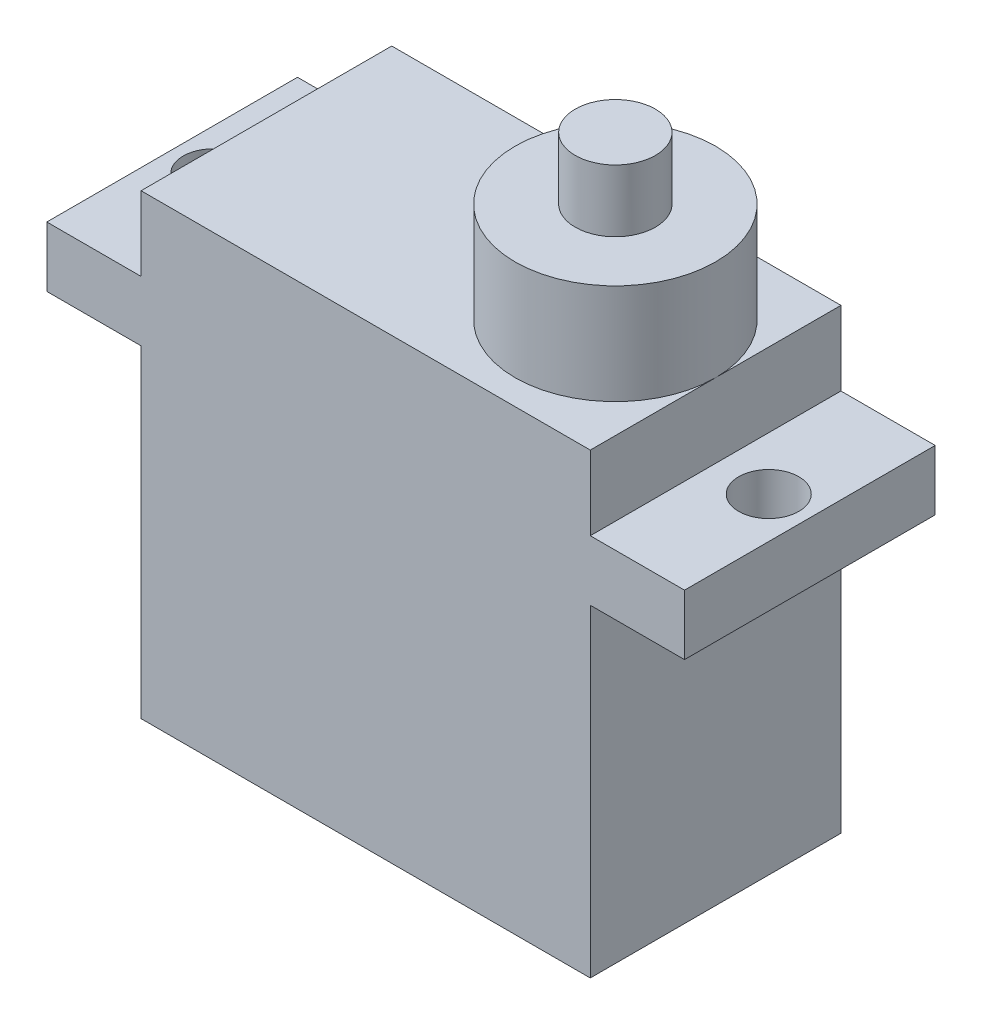
ISO-10303-21;
HEADER;
FILE_DESCRIPTION(('STEP AP214'),'2;1');
FILE_NAME('part.step','',(''),(''),'','','');
FILE_SCHEMA(('AUTOMOTIVE_DESIGN { 1 0 10303 214 1 1 1 1 }'));
ENDSEC;
DATA;
#1=APPLICATION_CONTEXT('core data for automotive mechanical design processes');
#2=APPLICATION_PROTOCOL_DEFINITION('international standard','automotive_design',2000,#1);
#3=PRODUCT_CONTEXT('',#1,'mechanical');
#4=PRODUCT('Part','Part','',(#3));
#5=PRODUCT_RELATED_PRODUCT_CATEGORY('part','',(#4));
#6=PRODUCT_DEFINITION_FORMATION('','',#4);
#7=PRODUCT_DEFINITION_CONTEXT('part definition',#1,'design');
#8=PRODUCT_DEFINITION('design','',#6,#7);
#9=PRODUCT_DEFINITION_SHAPE('','',#8);
#10=(LENGTH_UNIT() NAMED_UNIT(*) SI_UNIT(.MILLI.,.METRE.));
#11=(NAMED_UNIT(*) PLANE_ANGLE_UNIT() SI_UNIT($,.RADIAN.));
#12=(NAMED_UNIT(*) SI_UNIT($,.STERADIAN.) SOLID_ANGLE_UNIT());
#13=UNCERTAINTY_MEASURE_WITH_UNIT(LENGTH_MEASURE(1.E-05),#10,'distance_accuracy_value','');
#14=(GEOMETRIC_REPRESENTATION_CONTEXT(3) GLOBAL_UNCERTAINTY_ASSIGNED_CONTEXT((#13)) GLOBAL_UNIT_ASSIGNED_CONTEXT((#10,
#11,#12)) REPRESENTATION_CONTEXT('',''));
#15=CARTESIAN_POINT('',(0.,0.,0.));
#16=DIRECTION('',(0.,0.,1.));
#17=DIRECTION('',(1.,0.,0.));
#18=AXIS2_PLACEMENT_3D('',#15,#16,#17);
#19=CARTESIAN_POINT('',(0.,19.1,0.));
#20=DIRECTION('',(0.,1.,0.));
#21=DIRECTION('',(0.,0.,1.));
#22=AXIS2_PLACEMENT_3D('',#19,#20,#21);
#23=PLANE('',#22);
#24=DIRECTION('',(0.,0.,1.));
#25=VECTOR('',#24,1.);
#26=CARTESIAN_POINT('',(-11.2,19.1,0.));
#27=LINE('',#26,#25);
#28=CARTESIAN_POINT('',(-11.2,19.1,-6.25));
#29=VERTEX_POINT('',#28);
#30=CARTESIAN_POINT('',(-11.2,19.1,6.25));
#31=VERTEX_POINT('',#30);
#32=EDGE_CURVE('E44',#29,#31,#27,.T.);
#33=ORIENTED_EDGE('',*,*,#32,.F.);
#34=DIRECTION('',(-1.,0.,0.));
#35=VECTOR('',#34,1.);
#36=CARTESIAN_POINT('',(-15.9,19.1,-6.25));
#37=LINE('',#36,#35);
#38=CARTESIAN_POINT('',(-15.9,19.1,-6.25));
#39=VERTEX_POINT('',#38);
#40=EDGE_CURVE('E179',#29,#39,#37,.T.);
#41=ORIENTED_EDGE('',*,*,#40,.T.);
#42=DIRECTION('',(0.,0.,1.));
#43=VECTOR('',#42,1.);
#44=CARTESIAN_POINT('',(-15.9,19.1,-6.25));
#45=LINE('',#44,#43);
#46=CARTESIAN_POINT('',(-15.9,19.1,6.25));
#47=VERTEX_POINT('',#46);
#48=EDGE_CURVE('E183',#39,#47,#45,.T.);
#49=ORIENTED_EDGE('',*,*,#48,.T.);
#50=DIRECTION('',(1.,0.,0.));
#51=VECTOR('',#50,1.);
#52=CARTESIAN_POINT('',(-15.9,19.1,6.25));
#53=LINE('',#52,#51);
#54=EDGE_CURVE('E59',#47,#31,#53,.T.);
#55=ORIENTED_EDGE('',*,*,#54,.T.);
#56=EDGE_LOOP('',(#33,#41,#49,#55));
#57=FACE_BOUND('',#56,.T.);
#58=CARTESIAN_POINT('',(-13.85,19.1,0.));
#59=DIRECTION('',(0.,1.,0.));
#60=DIRECTION('',(0.,0.,1.));
#61=AXIS2_PLACEMENT_3D('',#58,#59,#60);
#62=CIRCLE('',#61,1.5);
#63=CARTESIAN_POINT('',(-13.85,19.1,1.5));
#64=VERTEX_POINT('',#63);
#65=EDGE_CURVE('E164',#64,#64,#62,.T.);
#66=ORIENTED_EDGE('',*,*,#65,.F.);
#67=EDGE_LOOP('',(#66));
#68=FACE_BOUND('',#67,.T.);
#69=ADVANCED_FACE('F36',(#57,#68),#23,.T.);
#70=CARTESIAN_POINT('',(11.2,16.1,-6.25));
#71=DIRECTION('',(-1.,0.,0.));
#72=DIRECTION('',(0.,0.,1.));
#73=AXIS2_PLACEMENT_3D('',#70,#71,#72);
#74=PLANE('',#73);
#75=DIRECTION('',(0.,0.,-1.));
#76=VECTOR('',#75,1.);
#77=CARTESIAN_POINT('',(11.2,0.,-6.25));
#78=LINE('',#77,#76);
#79=CARTESIAN_POINT('',(11.2,0.,6.25));
#80=VERTEX_POINT('',#79);
#81=CARTESIAN_POINT('',(11.2,0.,-6.25));
#82=VERTEX_POINT('',#81);
#83=EDGE_CURVE('E210',#80,#82,#78,.T.);
#84=ORIENTED_EDGE('',*,*,#83,.T.);
#85=DIRECTION('',(0.,-1.,0.));
#86=VECTOR('',#85,1.);
#87=CARTESIAN_POINT('',(11.2,16.1,-6.25));
#88=LINE('',#87,#86);
#89=CARTESIAN_POINT('',(11.2,16.1,-6.25));
#90=VERTEX_POINT('',#89);
#91=EDGE_CURVE('E234',#90,#82,#88,.T.);
#92=ORIENTED_EDGE('',*,*,#91,.F.);
#93=DIRECTION('',(0.,0.,-1.));
#94=VECTOR('',#93,1.);
#95=CARTESIAN_POINT('',(11.2,16.1,-6.25));
#96=LINE('',#95,#94);
#97=CARTESIAN_POINT('',(11.2,16.1,6.25));
#98=VERTEX_POINT('',#97);
#99=EDGE_CURVE('E211',#98,#90,#96,.T.);
#100=ORIENTED_EDGE('',*,*,#99,.F.);
#101=DIRECTION('',(0.,-1.,0.));
#102=VECTOR('',#101,1.);
#103=CARTESIAN_POINT('',(11.2,16.1,6.25));
#104=LINE('',#103,#102);
#105=EDGE_CURVE('E218',#98,#80,#104,.T.);
#106=ORIENTED_EDGE('',*,*,#105,.T.);
#107=EDGE_LOOP('',(#84,#92,#100,#106));
#108=FACE_BOUND('',#107,.T.);
#109=ADVANCED_FACE('F38',(#108),#74,.F.);
#110=CARTESIAN_POINT('',(-11.2,16.1,-6.25));
#111=DIRECTION('',(0.,0.,1.));
#112=DIRECTION('',(1.,0.,0.));
#113=AXIS2_PLACEMENT_3D('',#110,#111,#112);
#114=PLANE('',#113);
#115=DIRECTION('',(-1.,0.,0.));
#116=VECTOR('',#115,1.);
#117=CARTESIAN_POINT('',(-15.9,16.1,-6.25));
#118=LINE('',#117,#116);
#119=CARTESIAN_POINT('',(15.9,16.1,-6.25));
#120=VERTEX_POINT('',#119);
#121=EDGE_CURVE('E191',#120,#90,#118,.T.);
#122=ORIENTED_EDGE('',*,*,#121,.T.);
#123=ORIENTED_EDGE('',*,*,#91,.T.);
#124=DIRECTION('',(-1.,0.,0.));
#125=VECTOR('',#124,1.);
#126=CARTESIAN_POINT('',(-11.2,0.,-6.25));
#127=LINE('',#126,#125);
#128=CARTESIAN_POINT('',(-11.2,0.,-6.25));
#129=VERTEX_POINT('',#128);
#130=EDGE_CURVE('E221',#82,#129,#127,.T.);
#131=ORIENTED_EDGE('',*,*,#130,.T.);
#132=DIRECTION('',(0.,-1.,0.));
#133=VECTOR('',#132,1.);
#134=CARTESIAN_POINT('',(-11.2,16.1,-6.25));
#135=LINE('',#134,#133);
#136=CARTESIAN_POINT('',(-11.2,16.1,-6.25));
#137=VERTEX_POINT('',#136);
#138=EDGE_CURVE('E231',#137,#129,#135,.T.);
#139=ORIENTED_EDGE('',*,*,#138,.F.);
#140=CARTESIAN_POINT('',(-15.9,16.1,-6.25));
#141=VERTEX_POINT('',#140);
#142=EDGE_CURVE('E190',#137,#141,#118,.T.);
#143=ORIENTED_EDGE('',*,*,#142,.T.);
#144=DIRECTION('',(0.,-1.,0.));
#145=VECTOR('',#144,1.);
#146=CARTESIAN_POINT('',(-15.9,19.1,-6.25));
#147=LINE('',#146,#145);
#148=EDGE_CURVE('E204',#39,#141,#147,.T.);
#149=ORIENTED_EDGE('',*,*,#148,.F.);
#150=ORIENTED_EDGE('',*,*,#40,.F.);
#151=DIRECTION('',(0.,-1.,0.));
#152=VECTOR('',#151,1.);
#153=CARTESIAN_POINT('',(-11.2,22.8,-6.25));
#154=LINE('',#153,#152);
#155=CARTESIAN_POINT('',(-11.2,22.8,-6.25));
#156=VERTEX_POINT('',#155);
#157=EDGE_CURVE('E154',#156,#29,#154,.T.);
#158=ORIENTED_EDGE('',*,*,#157,.F.);
#159=DIRECTION('',(1.,0.,0.));
#160=VECTOR('',#159,1.);
#161=CARTESIAN_POINT('',(-11.2,22.8,-6.25));
#162=LINE('',#161,#160);
#163=CARTESIAN_POINT('',(11.2,22.8,-6.25));
#164=VERTEX_POINT('',#163);
#165=EDGE_CURVE('E148',#156,#164,#162,.T.);
#166=ORIENTED_EDGE('',*,*,#165,.T.);
#167=DIRECTION('',(0.,-1.,0.));
#168=VECTOR('',#167,1.);
#169=CARTESIAN_POINT('',(11.2,22.8,-6.25));
#170=LINE('',#169,#168);
#171=CARTESIAN_POINT('',(11.2,19.1,-6.25));
#172=VERTEX_POINT('',#171);
#173=EDGE_CURVE('E135',#164,#172,#170,.T.);
#174=ORIENTED_EDGE('',*,*,#173,.T.);
#175=CARTESIAN_POINT('',(15.9,19.1,-6.25));
#176=VERTEX_POINT('',#175);
#177=EDGE_CURVE('E181',#176,#172,#37,.T.);
#178=ORIENTED_EDGE('',*,*,#177,.F.);
#179=DIRECTION('',(0.,-1.,0.));
#180=VECTOR('',#179,1.);
#181=CARTESIAN_POINT('',(15.9,19.1,-6.25));
#182=LINE('',#181,#180);
#183=EDGE_CURVE('E207',#176,#120,#182,.T.);
#184=ORIENTED_EDGE('',*,*,#183,.T.);
#185=EDGE_LOOP('',(#122,#123,#131,#139,#143,#149,#150,#158,#166,#174,#178,#184));
#186=FACE_BOUND('',#185,.T.);
#187=ADVANCED_FACE('F244',(#186),#114,.F.);
#188=CARTESIAN_POINT('',(-11.2,16.1,-6.25));
#189=DIRECTION('',(1.,0.,0.));
#190=DIRECTION('',(0.,0.,-1.));
#191=AXIS2_PLACEMENT_3D('',#188,#189,#190);
#192=PLANE('',#191);
#193=DIRECTION('',(0.,0.,1.));
#194=VECTOR('',#193,1.);
#195=CARTESIAN_POINT('',(-11.2,0.,-6.25));
#196=LINE('',#195,#194);
#197=CARTESIAN_POINT('',(-11.2,0.,6.25));
#198=VERTEX_POINT('',#197);
#199=EDGE_CURVE('E223',#129,#198,#196,.T.);
#200=ORIENTED_EDGE('',*,*,#199,.T.);
#201=DIRECTION('',(0.,-1.,0.));
#202=VECTOR('',#201,1.);
#203=CARTESIAN_POINT('',(-11.2,16.1,6.25));
#204=LINE('',#203,#202);
#205=CARTESIAN_POINT('',(-11.2,16.1,6.25));
#206=VERTEX_POINT('',#205);
#207=EDGE_CURVE('E228',#206,#198,#204,.T.);
#208=ORIENTED_EDGE('',*,*,#207,.F.);
#209=DIRECTION('',(0.,0.,1.));
#210=VECTOR('',#209,1.);
#211=CARTESIAN_POINT('',(-11.2,16.1,-6.25));
#212=LINE('',#211,#210);
#213=EDGE_CURVE('E214',#137,#206,#212,.T.);
#214=ORIENTED_EDGE('',*,*,#213,.F.);
#215=ORIENTED_EDGE('',*,*,#138,.T.);
#216=EDGE_LOOP('',(#200,#208,#214,#215));
#217=FACE_BOUND('',#216,.T.);
#218=ADVANCED_FACE('F309',(#217),#192,.F.);
#219=CARTESIAN_POINT('',(-11.2,16.1,6.25));
#220=DIRECTION('',(0.,0.,-1.));
#221=DIRECTION('',(-1.,0.,0.));
#222=AXIS2_PLACEMENT_3D('',#219,#220,#221);
#223=PLANE('',#222);
#224=CARTESIAN_POINT('',(11.2,19.1,6.25));
#225=VERTEX_POINT('',#224);
#226=CARTESIAN_POINT('',(15.9,19.1,6.25));
#227=VERTEX_POINT('',#226);
#228=EDGE_CURVE('E185',#225,#227,#53,.T.);
#229=ORIENTED_EDGE('',*,*,#228,.F.);
#230=DIRECTION('',(0.,-1.,0.));
#231=VECTOR('',#230,1.);
#232=CARTESIAN_POINT('',(11.2,22.8,6.25));
#233=LINE('',#232,#231);
#234=CARTESIAN_POINT('',(11.2,22.8,6.25));
#235=VERTEX_POINT('',#234);
#236=EDGE_CURVE('E159',#235,#225,#233,.T.);
#237=ORIENTED_EDGE('',*,*,#236,.F.);
#238=DIRECTION('',(-1.,0.,0.));
#239=VECTOR('',#238,1.);
#240=CARTESIAN_POINT('',(-11.2,22.8,6.25));
#241=LINE('',#240,#239);
#242=CARTESIAN_POINT('',(-11.2,22.8,6.25));
#243=VERTEX_POINT('',#242);
#244=EDGE_CURVE('E140',#235,#243,#241,.T.);
#245=ORIENTED_EDGE('',*,*,#244,.T.);
#246=DIRECTION('',(0.,-1.,0.));
#247=VECTOR('',#246,1.);
#248=CARTESIAN_POINT('',(-11.2,22.8,6.25));
#249=LINE('',#248,#247);
#250=EDGE_CURVE('E155',#243,#31,#249,.T.);
#251=ORIENTED_EDGE('',*,*,#250,.T.);
#252=ORIENTED_EDGE('',*,*,#54,.F.);
#253=DIRECTION('',(0.,-1.,0.));
#254=VECTOR('',#253,1.);
#255=CARTESIAN_POINT('',(-15.9,19.1,6.25));
#256=LINE('',#255,#254);
#257=CARTESIAN_POINT('',(-15.9,16.1,6.25));
#258=VERTEX_POINT('',#257);
#259=EDGE_CURVE('E201',#47,#258,#256,.T.);
#260=ORIENTED_EDGE('',*,*,#259,.T.);
#261=DIRECTION('',(1.,0.,0.));
#262=VECTOR('',#261,1.);
#263=CARTESIAN_POINT('',(-15.9,16.1,6.25));
#264=LINE('',#263,#262);
#265=EDGE_CURVE('E180',#258,#206,#264,.T.);
#266=ORIENTED_EDGE('',*,*,#265,.T.);
#267=ORIENTED_EDGE('',*,*,#207,.T.);
#268=DIRECTION('',(1.,0.,0.));
#269=VECTOR('',#268,1.);
#270=CARTESIAN_POINT('',(-11.2,0.,6.25));
#271=LINE('',#270,#269);
#272=EDGE_CURVE('E215',#198,#80,#271,.T.);
#273=ORIENTED_EDGE('',*,*,#272,.T.);
#274=ORIENTED_EDGE('',*,*,#105,.F.);
#275=CARTESIAN_POINT('',(15.9,16.1,6.25));
#276=VERTEX_POINT('',#275);
#277=EDGE_CURVE('E196',#98,#276,#264,.T.);
#278=ORIENTED_EDGE('',*,*,#277,.T.);
#279=DIRECTION('',(0.,-1.,0.));
#280=VECTOR('',#279,1.);
#281=CARTESIAN_POINT('',(15.9,19.1,6.25));
#282=LINE('',#281,#280);
#283=EDGE_CURVE('E187',#227,#276,#282,.T.);
#284=ORIENTED_EDGE('',*,*,#283,.F.);
#285=EDGE_LOOP('',(#229,#237,#245,#251,#252,#260,#266,#267,#273,#274,#278,#284));
#286=FACE_BOUND('',#285,.T.);
#287=ADVANCED_FACE('F241',(#286),#223,.F.);
#288=CARTESIAN_POINT('',(0.,0.,0.));
#289=DIRECTION('',(0.,1.,0.));
#290=DIRECTION('',(0.,0.,1.));
#291=AXIS2_PLACEMENT_3D('',#288,#289,#290);
#292=PLANE('',#291);
#293=ORIENTED_EDGE('',*,*,#83,.F.);
#294=ORIENTED_EDGE('',*,*,#272,.F.);
#295=ORIENTED_EDGE('',*,*,#199,.F.);
#296=ORIENTED_EDGE('',*,*,#130,.F.);
#297=EDGE_LOOP('',(#293,#294,#295,#296));
#298=FACE_BOUND('',#297,.T.);
#299=ADVANCED_FACE('F298',(#298),#292,.F.);
#300=CARTESIAN_POINT('',(0.,16.1,0.));
#301=DIRECTION('',(0.,1.,0.));
#302=DIRECTION('',(0.,0.,1.));
#303=AXIS2_PLACEMENT_3D('',#300,#301,#302);
#304=PLANE('',#303);
#305=CARTESIAN_POINT('',(13.85,16.1,0.));
#306=DIRECTION('',(0.,1.,0.));
#307=DIRECTION('',(0.,0.,1.));
#308=AXIS2_PLACEMENT_3D('',#305,#306,#307);
#309=CIRCLE('',#308,1.5);
#310=CARTESIAN_POINT('',(13.85,16.1,1.49999999999999));
#311=VERTEX_POINT('',#310);
#312=EDGE_CURVE('E167',#311,#311,#309,.T.);
#313=ORIENTED_EDGE('',*,*,#312,.T.);
#314=EDGE_LOOP('',(#313));
#315=FACE_BOUND('',#314,.T.);
#316=ORIENTED_EDGE('',*,*,#277,.F.);
#317=ORIENTED_EDGE('',*,*,#99,.T.);
#318=ORIENTED_EDGE('',*,*,#121,.F.);
#319=DIRECTION('',(0.,0.,-1.));
#320=VECTOR('',#319,1.);
#321=CARTESIAN_POINT('',(15.9,16.1,-6.25));
#322=LINE('',#321,#320);
#323=EDGE_CURVE('E173',#276,#120,#322,.T.);
#324=ORIENTED_EDGE('',*,*,#323,.F.);
#325=EDGE_LOOP('',(#316,#317,#318,#324));
#326=FACE_BOUND('',#325,.T.);
#327=ADVANCED_FACE('F285',(#315,#326),#304,.F.);
#328=CARTESIAN_POINT('',(-13.85,16.1,0.));
#329=DIRECTION('',(0.,1.,0.));
#330=DIRECTION('',(0.,0.,1.));
#331=AXIS2_PLACEMENT_3D('',#328,#329,#330);
#332=CIRCLE('',#331,1.5);
#333=CARTESIAN_POINT('',(-13.85,16.1,1.5));
#334=VERTEX_POINT('',#333);
#335=EDGE_CURVE('E158',#334,#334,#332,.T.);
#336=ORIENTED_EDGE('',*,*,#335,.T.);
#337=EDGE_LOOP('',(#336));
#338=FACE_BOUND('',#337,.T.);
#339=ORIENTED_EDGE('',*,*,#142,.F.);
#340=ORIENTED_EDGE('',*,*,#213,.T.);
#341=ORIENTED_EDGE('',*,*,#265,.F.);
#342=DIRECTION('',(0.,0.,1.));
#343=VECTOR('',#342,1.);
#344=CARTESIAN_POINT('',(-15.9,16.1,-6.25));
#345=LINE('',#344,#343);
#346=EDGE_CURVE('E194',#141,#258,#345,.T.);
#347=ORIENTED_EDGE('',*,*,#346,.F.);
#348=EDGE_LOOP('',(#339,#340,#341,#347));
#349=FACE_BOUND('',#348,.T.);
#350=ADVANCED_FACE('F277',(#338,#349),#304,.F.);
#351=DIRECTION('',(0.,0.,-1.));
#352=VECTOR('',#351,1.);
#353=CARTESIAN_POINT('',(11.2,19.1,0.));
#354=LINE('',#353,#352);
#355=EDGE_CURVE('E51',#225,#172,#354,.T.);
#356=ORIENTED_EDGE('',*,*,#355,.F.);
#357=ORIENTED_EDGE('',*,*,#228,.T.);
#358=DIRECTION('',(0.,0.,-1.));
#359=VECTOR('',#358,1.);
#360=CARTESIAN_POINT('',(15.9,19.1,-6.25));
#361=LINE('',#360,#359);
#362=EDGE_CURVE('E176',#227,#176,#361,.T.);
#363=ORIENTED_EDGE('',*,*,#362,.T.);
#364=ORIENTED_EDGE('',*,*,#177,.T.);
#365=EDGE_LOOP('',(#356,#357,#363,#364));
#366=FACE_BOUND('',#365,.T.);
#367=CARTESIAN_POINT('',(13.85,19.1,0.));
#368=DIRECTION('',(0.,1.,0.));
#369=DIRECTION('',(0.,0.,1.));
#370=AXIS2_PLACEMENT_3D('',#367,#368,#369);
#371=CIRCLE('',#370,1.5);
#372=CARTESIAN_POINT('',(13.85,19.1,1.49999999999999));
#373=VERTEX_POINT('',#372);
#374=EDGE_CURVE('E170',#373,#373,#371,.T.);
#375=ORIENTED_EDGE('',*,*,#374,.F.);
#376=EDGE_LOOP('',(#375));
#377=FACE_BOUND('',#376,.T.);
#378=ADVANCED_FACE('F267',(#366,#377),#23,.T.);
#379=CARTESIAN_POINT('',(15.9,19.1,-6.25));
#380=DIRECTION('',(-1.,0.,0.));
#381=DIRECTION('',(0.,0.,1.));
#382=AXIS2_PLACEMENT_3D('',#379,#380,#381);
#383=PLANE('',#382);
#384=ORIENTED_EDGE('',*,*,#323,.T.);
#385=ORIENTED_EDGE('',*,*,#183,.F.);
#386=ORIENTED_EDGE('',*,*,#362,.F.);
#387=ORIENTED_EDGE('',*,*,#283,.T.);
#388=EDGE_LOOP('',(#384,#385,#386,#387));
#389=FACE_BOUND('',#388,.T.);
#390=ADVANCED_FACE('F276',(#389),#383,.F.);
#391=CARTESIAN_POINT('',(-15.9,19.1,-6.25));
#392=DIRECTION('',(1.,0.,0.));
#393=DIRECTION('',(0.,0.,-1.));
#394=AXIS2_PLACEMENT_3D('',#391,#392,#393);
#395=PLANE('',#394);
#396=ORIENTED_EDGE('',*,*,#346,.T.);
#397=ORIENTED_EDGE('',*,*,#259,.F.);
#398=ORIENTED_EDGE('',*,*,#48,.F.);
#399=ORIENTED_EDGE('',*,*,#148,.T.);
#400=EDGE_LOOP('',(#396,#397,#398,#399));
#401=FACE_BOUND('',#400,.T.);
#402=ADVANCED_FACE('F282',(#401),#395,.F.);
#403=CARTESIAN_POINT('',(13.85,19.1,0.));
#404=DIRECTION('',(0.,-1.,0.));
#405=DIRECTION('',(0.,0.,-1.));
#406=AXIS2_PLACEMENT_3D('',#403,#404,#405);
#407=CYLINDRICAL_SURFACE('',#406,1.5);
#408=ORIENTED_EDGE('',*,*,#374,.T.);
#409=EDGE_LOOP('',(#408));
#410=FACE_BOUND('',#409,.T.);
#411=ORIENTED_EDGE('',*,*,#312,.F.);
#412=EDGE_LOOP('',(#411));
#413=FACE_BOUND('',#412,.T.);
#414=ADVANCED_FACE('F290',(#410,#413),#407,.F.);
#415=CARTESIAN_POINT('',(-13.85,19.1,0.));
#416=DIRECTION('',(0.,-1.,0.));
#417=DIRECTION('',(0.,0.,-1.));
#418=AXIS2_PLACEMENT_3D('',#415,#416,#417);
#419=CYLINDRICAL_SURFACE('',#418,1.5);
#420=ORIENTED_EDGE('',*,*,#65,.T.);
#421=EDGE_LOOP('',(#420));
#422=FACE_BOUND('',#421,.T.);
#423=ORIENTED_EDGE('',*,*,#335,.F.);
#424=EDGE_LOOP('',(#423));
#425=FACE_BOUND('',#424,.T.);
#426=ADVANCED_FACE('F293',(#422,#425),#419,.F.);
#427=CARTESIAN_POINT('',(-11.2,22.8,6.25));
#428=DIRECTION('',(-1.,0.,0.));
#429=DIRECTION('',(0.,0.,1.));
#430=AXIS2_PLACEMENT_3D('',#427,#428,#429);
#431=PLANE('',#430);
#432=ORIENTED_EDGE('',*,*,#157,.T.);
#433=ORIENTED_EDGE('',*,*,#32,.T.);
#434=ORIENTED_EDGE('',*,*,#250,.F.);
#435=DIRECTION('',(0.,0.,-1.));
#436=VECTOR('',#435,1.);
#437=CARTESIAN_POINT('',(-11.2,22.8,6.25));
#438=LINE('',#437,#436);
#439=EDGE_CURVE('E149',#243,#156,#438,.T.);
#440=ORIENTED_EDGE('',*,*,#439,.T.);
#441=EDGE_LOOP('',(#432,#433,#434,#440));
#442=FACE_BOUND('',#441,.T.);
#443=ADVANCED_FACE('F238',(#442),#431,.T.);
#444=CARTESIAN_POINT('',(11.2,22.8,6.25));
#445=DIRECTION('',(1.,0.,0.));
#446=DIRECTION('',(0.,0.,-1.));
#447=AXIS2_PLACEMENT_3D('',#444,#445,#446);
#448=PLANE('',#447);
#449=ORIENTED_EDGE('',*,*,#236,.T.);
#450=ORIENTED_EDGE('',*,*,#355,.T.);
#451=ORIENTED_EDGE('',*,*,#173,.F.);
#452=DIRECTION('',(0.,0.,1.));
#453=VECTOR('',#452,1.);
#454=CARTESIAN_POINT('',(11.2,22.8,6.25));
#455=LINE('',#454,#453);
#456=CARTESIAN_POINT('',(11.2,22.8,0.));
#457=VERTEX_POINT('',#456);
#458=EDGE_CURVE('E128',#164,#457,#455,.T.);
#459=ORIENTED_EDGE('',*,*,#458,.T.);
#460=EDGE_CURVE('E132',#457,#235,#455,.T.);
#461=ORIENTED_EDGE('',*,*,#460,.T.);
#462=EDGE_LOOP('',(#449,#450,#451,#459,#461));
#463=FACE_BOUND('',#462,.T.);
#464=ADVANCED_FACE('F131',(#463),#448,.T.);
#465=CARTESIAN_POINT('',(0.,22.8,0.));
#466=DIRECTION('',(0.,-1.,0.));
#467=DIRECTION('',(0.,0.,-1.));
#468=AXIS2_PLACEMENT_3D('',#465,#466,#467);
#469=PLANE('',#468);
#470=ORIENTED_EDGE('',*,*,#460,.F.);
#471=CARTESIAN_POINT('',(6.2,22.8,0.));
#472=DIRECTION('',(0.,1.,0.));
#473=DIRECTION('',(0.,0.,1.));
#474=AXIS2_PLACEMENT_3D('',#471,#472,#473);
#475=CIRCLE('',#474,5.);
#476=EDGE_CURVE('E145',#457,#457,#475,.T.);
#477=ORIENTED_EDGE('',*,*,#476,.F.);
#478=ORIENTED_EDGE('',*,*,#458,.F.);
#479=ORIENTED_EDGE('',*,*,#165,.F.);
#480=ORIENTED_EDGE('',*,*,#439,.F.);
#481=ORIENTED_EDGE('',*,*,#244,.F.);
#482=EDGE_LOOP('',(#470,#477,#478,#479,#480,#481));
#483=FACE_BOUND('',#482,.T.);
#484=ADVANCED_FACE('F143',(#483),#469,.F.);
#485=CARTESIAN_POINT('',(6.2,27.8,0.));
#486=DIRECTION('',(0.,-1.,0.));
#487=DIRECTION('',(0.,0.,-1.));
#488=AXIS2_PLACEMENT_3D('',#485,#486,#487);
#489=CYLINDRICAL_SURFACE('',#488,5.);
#490=CARTESIAN_POINT('',(6.2,27.8,0.));
#491=DIRECTION('',(0.,1.,0.));
#492=DIRECTION('',(0.,0.,1.));
#493=AXIS2_PLACEMENT_3D('',#490,#491,#492);
#494=CIRCLE('',#493,5.);
#495=CARTESIAN_POINT('',(6.2,27.8,5.));
#496=VERTEX_POINT('',#495);
#497=EDGE_CURVE('E245',#496,#496,#494,.T.);
#498=ORIENTED_EDGE('',*,*,#497,.F.);
#499=EDGE_LOOP('',(#498));
#500=FACE_BOUND('',#499,.T.);
#501=ORIENTED_EDGE('',*,*,#476,.T.);
#502=EDGE_LOOP('',(#501));
#503=FACE_BOUND('',#502,.T.);
#504=ADVANCED_FACE('F422',(#500,#503),#489,.T.);
#505=CARTESIAN_POINT('',(6.2,27.8,0.));
#506=DIRECTION('',(0.,1.,0.));
#507=DIRECTION('',(0.,0.,1.));
#508=AXIS2_PLACEMENT_3D('',#505,#506,#507);
#509=PLANE('',#508);
#510=CARTESIAN_POINT('',(6.2,27.8,0.));
#511=DIRECTION('',(0.,1.,0.));
#512=DIRECTION('',(0.,0.,1.));
#513=AXIS2_PLACEMENT_3D('',#510,#511,#512);
#514=CIRCLE('',#513,2.);
#515=CARTESIAN_POINT('',(6.2,27.8,2.));
#516=VERTEX_POINT('',#515);
#517=EDGE_CURVE('E11',#516,#516,#514,.T.);
#518=ORIENTED_EDGE('',*,*,#517,.F.);
#519=EDGE_LOOP('',(#518));
#520=FACE_BOUND('',#519,.T.);
#521=ORIENTED_EDGE('',*,*,#497,.T.);
#522=EDGE_LOOP('',(#521));
#523=FACE_BOUND('',#522,.T.);
#524=ADVANCED_FACE('F262',(#520,#523),#509,.T.);
#525=CARTESIAN_POINT('',(6.2,30.9,0.));
#526=DIRECTION('',(0.,-1.,0.));
#527=DIRECTION('',(0.,0.,-1.));
#528=AXIS2_PLACEMENT_3D('',#525,#526,#527);
#529=CYLINDRICAL_SURFACE('',#528,2.);
#530=ORIENTED_EDGE('',*,*,#517,.T.);
#531=EDGE_LOOP('',(#530));
#532=FACE_BOUND('',#531,.T.);
#533=CARTESIAN_POINT('',(6.2,30.9,0.));
#534=DIRECTION('',(0.,-1.,0.));
#535=DIRECTION('',(0.,0.,-1.));
#536=AXIS2_PLACEMENT_3D('',#533,#534,#535);
#537=CIRCLE('',#536,2.);
#538=CARTESIAN_POINT('',(6.2,30.9,-2.));
#539=VERTEX_POINT('',#538);
#540=EDGE_CURVE('E249',#539,#539,#537,.T.);
#541=ORIENTED_EDGE('',*,*,#540,.T.);
#542=EDGE_LOOP('',(#541));
#543=FACE_BOUND('',#542,.T.);
#544=ADVANCED_FACE('F254',(#532,#543),#529,.T.);
#545=CARTESIAN_POINT('',(6.2,30.9,0.));
#546=DIRECTION('',(0.,-1.,0.));
#547=DIRECTION('',(0.,0.,-1.));
#548=AXIS2_PLACEMENT_3D('',#545,#546,#547);
#549=PLANE('',#548);
#550=ORIENTED_EDGE('',*,*,#540,.F.);
#551=EDGE_LOOP('',(#550));
#552=FACE_BOUND('',#551,.T.);
#553=ADVANCED_FACE('F256',(#552),#549,.F.);
#554=CLOSED_SHELL('',(#69,#109,#187,#218,#287,#299,#327,#350,#378,#390,#402,#414,#426,#443,#464,
#484,#504,#524,#544,#553));
#555=MANIFOLD_SOLID_BREP('B2',#554);
#556=ADVANCED_BREP_SHAPE_REPRESENTATION('',(#18,#555),#14);
#557=SHAPE_DEFINITION_REPRESENTATION(#9,#556);
ENDSEC;
END-ISO-10303-21;
